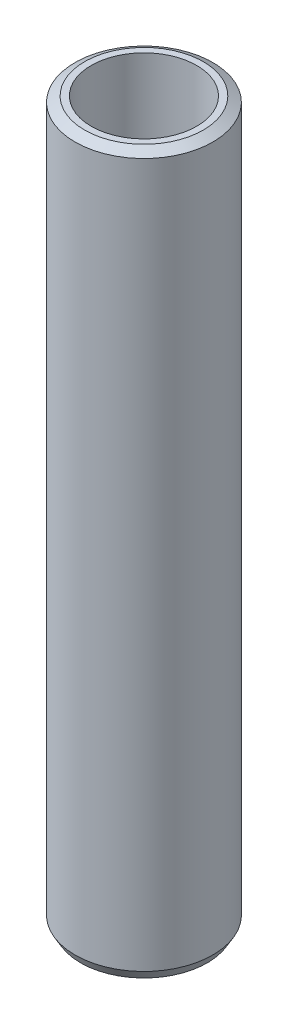
ISO-10303-21;
HEADER;
FILE_DESCRIPTION(('STEP AP214'),'2;1');
FILE_NAME('part.step','',(''),(''),'','','');
FILE_SCHEMA(('AUTOMOTIVE_DESIGN { 1 0 10303 214 1 1 1 1 }'));
ENDSEC;
DATA;
#1=APPLICATION_CONTEXT('core data for automotive mechanical design processes');
#2=APPLICATION_PROTOCOL_DEFINITION('international standard','automotive_design',2000,#1);
#3=PRODUCT_CONTEXT('',#1,'mechanical');
#4=PRODUCT('Part','Part','',(#3));
#5=PRODUCT_RELATED_PRODUCT_CATEGORY('part','',(#4));
#6=PRODUCT_DEFINITION_FORMATION('','',#4);
#7=PRODUCT_DEFINITION_CONTEXT('part definition',#1,'design');
#8=PRODUCT_DEFINITION('design','',#6,#7);
#9=PRODUCT_DEFINITION_SHAPE('','',#8);
#10=(LENGTH_UNIT() NAMED_UNIT(*) SI_UNIT(.MILLI.,.METRE.));
#11=(NAMED_UNIT(*) PLANE_ANGLE_UNIT() SI_UNIT($,.RADIAN.));
#12=(NAMED_UNIT(*) SI_UNIT($,.STERADIAN.) SOLID_ANGLE_UNIT());
#13=UNCERTAINTY_MEASURE_WITH_UNIT(LENGTH_MEASURE(1.E-05),#10,'distance_accuracy_value','');
#14=(GEOMETRIC_REPRESENTATION_CONTEXT(3) GLOBAL_UNCERTAINTY_ASSIGNED_CONTEXT((#13)) GLOBAL_UNIT_ASSIGNED_CONTEXT((#10,
#11,#12)) REPRESENTATION_CONTEXT('',''));
#15=CARTESIAN_POINT('',(0.,0.,0.));
#16=DIRECTION('',(0.,0.,1.));
#17=DIRECTION('',(1.,0.,0.));
#18=AXIS2_PLACEMENT_3D('',#15,#16,#17);
#19=CARTESIAN_POINT('',(0.,600.,0.));
#20=DIRECTION('',(0.,-1.,0.));
#21=DIRECTION('',(0.,0.,-1.));
#22=AXIS2_PLACEMENT_3D('',#19,#20,#21);
#23=CYLINDRICAL_SURFACE('',#22,57.5);
#24=CARTESIAN_POINT('',(0.,595.373967775804,0.));
#25=DIRECTION('',(0.,1.,0.));
#26=DIRECTION('',(0.,0.,1.));
#27=AXIS2_PLACEMENT_3D('',#24,#25,#26);
#28=CIRCLE('',#27,57.5);
#29=CARTESIAN_POINT('',(0.,595.373967775804,57.5));
#30=VERTEX_POINT('',#29);
#31=EDGE_CURVE('E50',#30,#30,#28,.F.);
#32=ORIENTED_EDGE('',*,*,#31,.T.);
#33=EDGE_LOOP('',(#32));
#34=FACE_BOUND('',#33,.T.);
#35=CARTESIAN_POINT('',(0.,8.01252284975817,0.));
#36=DIRECTION('',(0.,1.,0.));
#37=DIRECTION('',(0.,0.,1.));
#38=AXIS2_PLACEMENT_3D('',#35,#36,#37);
#39=CIRCLE('',#38,57.5);
#40=CARTESIAN_POINT('',(0.,8.01252284975817,57.5));
#41=VERTEX_POINT('',#40);
#42=EDGE_CURVE('E51',#41,#41,#39,.T.);
#43=ORIENTED_EDGE('',*,*,#42,.T.);
#44=EDGE_LOOP('',(#43));
#45=FACE_BOUND('',#44,.T.);
#46=ADVANCED_FACE('F39',(#34,#45),#23,.T.);
#47=CARTESIAN_POINT('',(0.,600.,0.));
#48=DIRECTION('',(0.,1.,0.));
#49=DIRECTION('',(0.,0.,1.));
#50=AXIS2_PLACEMENT_3D('',#47,#48,#49);
#51=PLANE('',#50);
#52=CARTESIAN_POINT('',(0.,600.,0.));
#53=DIRECTION('',(0.,1.,0.));
#54=DIRECTION('',(0.,0.,1.));
#55=AXIS2_PLACEMENT_3D('',#52,#53,#54);
#56=CIRCLE('',#55,49.4874771502421);
#57=CARTESIAN_POINT('',(0.,600.,49.4874771502421));
#58=VERTEX_POINT('',#57);
#59=EDGE_CURVE('E54',#58,#58,#56,.T.);
#60=ORIENTED_EDGE('',*,*,#59,.T.);
#61=EDGE_LOOP('',(#60));
#62=FACE_BOUND('',#61,.T.);
#63=CARTESIAN_POINT('',(0.,600.,0.));
#64=DIRECTION('',(0.,1.,0.));
#65=DIRECTION('',(0.,0.,1.));
#66=AXIS2_PLACEMENT_3D('',#63,#64,#65);
#67=CIRCLE('',#66,44.0033274671042);
#68=CARTESIAN_POINT('',(0.,600.,44.0033274671042));
#69=VERTEX_POINT('',#68);
#70=EDGE_CURVE('E58',#69,#69,#67,.T.);
#71=ORIENTED_EDGE('',*,*,#70,.F.);
#72=EDGE_LOOP('',(#71));
#73=FACE_BOUND('',#72,.T.);
#74=ADVANCED_FACE('F69',(#62,#73),#51,.T.);
#75=CARTESIAN_POINT('',(0.,0.,0.));
#76=DIRECTION('',(0.,1.,0.));
#77=DIRECTION('',(0.,0.,1.));
#78=AXIS2_PLACEMENT_3D('',#75,#76,#77);
#79=PLANE('',#78);
#80=CARTESIAN_POINT('',(0.,0.,0.));
#81=DIRECTION('',(0.,1.,0.));
#82=DIRECTION('',(0.,0.,1.));
#83=AXIS2_PLACEMENT_3D('',#80,#81,#82);
#84=CIRCLE('',#83,52.8739677758041);
#85=CARTESIAN_POINT('',(0.,0.,52.8739677758041));
#86=VERTEX_POINT('',#85);
#87=EDGE_CURVE('E10',#86,#86,#84,.F.);
#88=ORIENTED_EDGE('',*,*,#87,.T.);
#89=EDGE_LOOP('',(#88));
#90=FACE_BOUND('',#89,.T.);
#91=CARTESIAN_POINT('',(0.,0.,0.));
#92=DIRECTION('',(0.,1.,0.));
#93=DIRECTION('',(0.,0.,1.));
#94=AXIS2_PLACEMENT_3D('',#91,#92,#93);
#95=CIRCLE('',#94,44.0033274671042);
#96=CARTESIAN_POINT('',(0.,0.,44.0033274671042));
#97=VERTEX_POINT('',#96);
#98=EDGE_CURVE('E63',#97,#97,#95,.T.);
#99=ORIENTED_EDGE('',*,*,#98,.T.);
#100=EDGE_LOOP('',(#99));
#101=FACE_BOUND('',#100,.T.);
#102=ADVANCED_FACE('F75',(#90,#101),#79,.F.);
#103=CARTESIAN_POINT('',(0.,600.,0.));
#104=DIRECTION('',(0.,-1.,0.));
#105=DIRECTION('',(0.,0.,-1.));
#106=AXIS2_PLACEMENT_3D('',#103,#104,#105);
#107=CYLINDRICAL_SURFACE('',#106,44.0033274671042);
#108=ORIENTED_EDGE('',*,*,#70,.T.);
#109=EDGE_LOOP('',(#108));
#110=FACE_BOUND('',#109,.T.);
#111=ORIENTED_EDGE('',*,*,#98,.F.);
#112=EDGE_LOOP('',(#111));
#113=FACE_BOUND('',#112,.T.);
#114=ADVANCED_FACE('F70',(#110,#113),#107,.F.);
#115=CARTESIAN_POINT('',(0.,600.,0.));
#116=DIRECTION('',(0.,-1.,0.));
#117=DIRECTION('',(0.,0.,-1.));
#118=AXIS2_PLACEMENT_3D('',#115,#116,#117);
#119=CONICAL_SURFACE('',#118,49.4874771502421,1.0471975511966);
#120=ORIENTED_EDGE('',*,*,#31,.F.);
#121=EDGE_LOOP('',(#120));
#122=FACE_BOUND('',#121,.T.);
#123=ORIENTED_EDGE('',*,*,#59,.F.);
#124=EDGE_LOOP('',(#123));
#125=FACE_BOUND('',#124,.T.);
#126=ADVANCED_FACE('F81',(#122,#125),#119,.T.);
#127=CARTESIAN_POINT('',(0.,8.01252284975817,0.));
#128=DIRECTION('',(0.,1.,0.));
#129=DIRECTION('',(0.,0.,1.));
#130=AXIS2_PLACEMENT_3D('',#127,#128,#129);
#131=CONICAL_SURFACE('',#130,57.5,0.523598775598303);
#132=ORIENTED_EDGE('',*,*,#87,.F.);
#133=EDGE_LOOP('',(#132));
#134=FACE_BOUND('',#133,.T.);
#135=ORIENTED_EDGE('',*,*,#42,.F.);
#136=EDGE_LOOP('',(#135));
#137=FACE_BOUND('',#136,.T.);
#138=ADVANCED_FACE('F45',(#134,#137),#131,.T.);
#139=CLOSED_SHELL('',(#46,#74,#102,#114,#126,#138));
#140=MANIFOLD_SOLID_BREP('B2',#139);
#141=ADVANCED_BREP_SHAPE_REPRESENTATION('',(#18,#140),#14);
#142=SHAPE_DEFINITION_REPRESENTATION(#9,#141);
ENDSEC;
END-ISO-10303-21;
